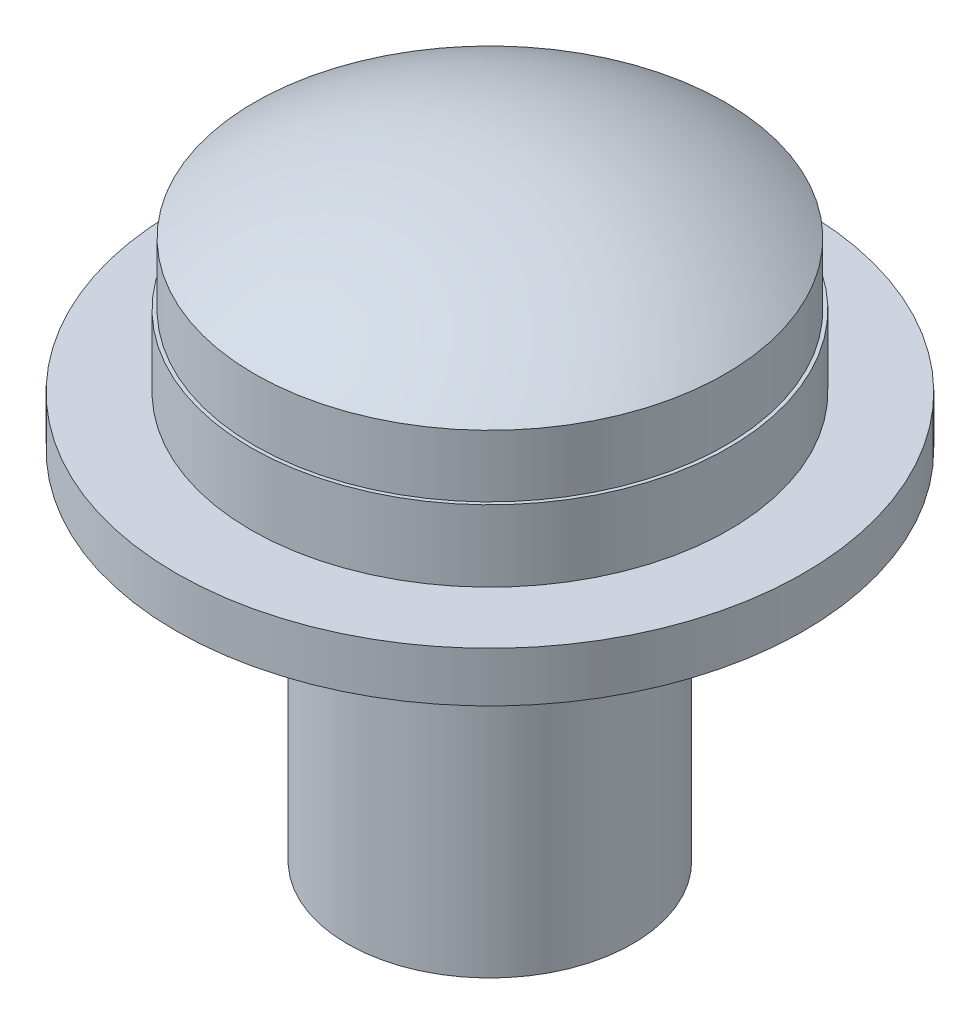
ISO-10303-21;
HEADER;
FILE_DESCRIPTION(('STEP AP214'),'2;1');
FILE_NAME('part.step','',(''),(''),'','','');
FILE_SCHEMA(('AUTOMOTIVE_DESIGN { 1 0 10303 214 1 1 1 1 }'));
ENDSEC;
DATA;
#1=APPLICATION_CONTEXT('core data for automotive mechanical design processes');
#2=APPLICATION_PROTOCOL_DEFINITION('international standard','automotive_design',2000,#1);
#3=PRODUCT_CONTEXT('',#1,'mechanical');
#4=PRODUCT('Part','Part','',(#3));
#5=PRODUCT_RELATED_PRODUCT_CATEGORY('part','',(#4));
#6=PRODUCT_DEFINITION_FORMATION('','',#4);
#7=PRODUCT_DEFINITION_CONTEXT('part definition',#1,'design');
#8=PRODUCT_DEFINITION('design','',#6,#7);
#9=PRODUCT_DEFINITION_SHAPE('','',#8);
#10=(LENGTH_UNIT() NAMED_UNIT(*) SI_UNIT(.MILLI.,.METRE.));
#11=(NAMED_UNIT(*) PLANE_ANGLE_UNIT() SI_UNIT($,.RADIAN.));
#12=(NAMED_UNIT(*) SI_UNIT($,.STERADIAN.) SOLID_ANGLE_UNIT());
#13=UNCERTAINTY_MEASURE_WITH_UNIT(LENGTH_MEASURE(1.E-05),#10,'distance_accuracy_value','');
#14=(GEOMETRIC_REPRESENTATION_CONTEXT(3) GLOBAL_UNCERTAINTY_ASSIGNED_CONTEXT((#13)) GLOBAL_UNIT_ASSIGNED_CONTEXT((#10,
#11,#12)) REPRESENTATION_CONTEXT('',''));
#15=CARTESIAN_POINT('',(0.,0.,0.));
#16=DIRECTION('',(0.,0.,1.));
#17=DIRECTION('',(1.,0.,0.));
#18=AXIS2_PLACEMENT_3D('',#15,#16,#17);
#19=CARTESIAN_POINT('',(0.,0.7,0.));
#20=DIRECTION('',(0.,-1.,0.));
#21=DIRECTION('',(0.,0.,-1.));
#22=AXIS2_PLACEMENT_3D('',#19,#20,#21);
#23=CYLINDRICAL_SURFACE('',#22,4.4);
#24=CARTESIAN_POINT('',(0.,0.7,0.));
#25=DIRECTION('',(0.,1.,0.));
#26=DIRECTION('',(0.,0.,1.));
#27=AXIS2_PLACEMENT_3D('',#24,#25,#26);
#28=CIRCLE('',#27,4.4);
#29=CARTESIAN_POINT('',(0.,0.7,4.4));
#30=VERTEX_POINT('',#29);
#31=EDGE_CURVE('E67',#30,#30,#28,.T.);
#32=ORIENTED_EDGE('',*,*,#31,.F.);
#33=EDGE_LOOP('',(#32));
#34=FACE_BOUND('',#33,.T.);
#35=CARTESIAN_POINT('',(0.,0.,0.));
#36=DIRECTION('',(0.,1.,0.));
#37=DIRECTION('',(0.,0.,1.));
#38=AXIS2_PLACEMENT_3D('',#35,#36,#37);
#39=CIRCLE('',#38,4.4);
#40=CARTESIAN_POINT('',(0.,0.,4.4));
#41=VERTEX_POINT('',#40);
#42=EDGE_CURVE('E64',#41,#41,#39,.T.);
#43=ORIENTED_EDGE('',*,*,#42,.T.);
#44=EDGE_LOOP('',(#43));
#45=FACE_BOUND('',#44,.T.);
#46=ADVANCED_FACE('F33',(#34,#45),#23,.T.);
#47=CARTESIAN_POINT('',(0.,0.7,0.));
#48=DIRECTION('',(0.,1.,0.));
#49=DIRECTION('',(0.,0.,1.));
#50=AXIS2_PLACEMENT_3D('',#47,#48,#49);
#51=PLANE('',#50);
#52=CARTESIAN_POINT('',(0.,0.7,0.));
#53=DIRECTION('',(0.,1.,0.));
#54=DIRECTION('',(0.,0.,1.));
#55=AXIS2_PLACEMENT_3D('',#52,#53,#54);
#56=CIRCLE('',#55,3.35);
#57=CARTESIAN_POINT('',(0.,0.7,3.35));
#58=VERTEX_POINT('',#57);
#59=EDGE_CURVE('E40',#58,#58,#56,.T.);
#60=ORIENTED_EDGE('',*,*,#59,.F.);
#61=EDGE_LOOP('',(#60));
#62=FACE_BOUND('',#61,.T.);
#63=ORIENTED_EDGE('',*,*,#31,.T.);
#64=EDGE_LOOP('',(#63));
#65=FACE_BOUND('',#64,.T.);
#66=ADVANCED_FACE('F76',(#62,#65),#51,.T.);
#67=CARTESIAN_POINT('',(0.,0.,0.));
#68=DIRECTION('',(0.,1.,0.));
#69=DIRECTION('',(0.,0.,1.));
#70=AXIS2_PLACEMENT_3D('',#67,#68,#69);
#71=PLANE('',#70);
#72=CARTESIAN_POINT('',(0.,0.,0.));
#73=DIRECTION('',(0.,-1.,0.));
#74=DIRECTION('',(0.,0.,-1.));
#75=AXIS2_PLACEMENT_3D('',#72,#73,#74);
#76=CIRCLE('',#75,2.);
#77=CARTESIAN_POINT('',(0.,0.,-2.));
#78=VERTEX_POINT('',#77);
#79=EDGE_CURVE('E11',#78,#78,#76,.T.);
#80=ORIENTED_EDGE('',*,*,#79,.F.);
#81=EDGE_LOOP('',(#80));
#82=FACE_BOUND('',#81,.T.);
#83=ORIENTED_EDGE('',*,*,#42,.F.);
#84=EDGE_LOOP('',(#83));
#85=FACE_BOUND('',#84,.T.);
#86=ADVANCED_FACE('F73',(#82,#85),#71,.F.);
#87=CARTESIAN_POINT('',(0.,1.7,0.));
#88=DIRECTION('',(0.,-1.,0.));
#89=DIRECTION('',(0.,0.,-1.));
#90=AXIS2_PLACEMENT_3D('',#87,#88,#89);
#91=CYLINDRICAL_SURFACE('',#90,3.35);
#92=CARTESIAN_POINT('',(0.,1.7,0.));
#93=DIRECTION('',(0.,-1.,0.));
#94=DIRECTION('',(0.,0.,-1.));
#95=AXIS2_PLACEMENT_3D('',#92,#93,#94);
#96=CIRCLE('',#95,3.35);
#97=CARTESIAN_POINT('',(0.,1.7,-3.35));
#98=VERTEX_POINT('',#97);
#99=EDGE_CURVE('E59',#98,#98,#96,.T.);
#100=ORIENTED_EDGE('',*,*,#99,.T.);
#101=EDGE_LOOP('',(#100));
#102=FACE_BOUND('',#101,.T.);
#103=ORIENTED_EDGE('',*,*,#59,.T.);
#104=EDGE_LOOP('',(#103));
#105=FACE_BOUND('',#104,.T.);
#106=ADVANCED_FACE('F75',(#102,#105),#91,.T.);
#107=CARTESIAN_POINT('',(0.,1.7,0.));
#108=DIRECTION('',(0.,-1.,0.));
#109=DIRECTION('',(0.,0.,-1.));
#110=AXIS2_PLACEMENT_3D('',#107,#108,#109);
#111=PLANE('',#110);
#112=CARTESIAN_POINT('',(0.,1.7,0.));
#113=DIRECTION('',(0.,-1.,0.));
#114=DIRECTION('',(0.,0.,-1.));
#115=AXIS2_PLACEMENT_3D('',#112,#113,#114);
#116=CIRCLE('',#115,3.3);
#117=CARTESIAN_POINT('',(0.,1.7,-3.3));
#118=VERTEX_POINT('',#117);
#119=EDGE_CURVE('E54',#118,#118,#116,.T.);
#120=ORIENTED_EDGE('',*,*,#119,.T.);
#121=EDGE_LOOP('',(#120));
#122=FACE_BOUND('',#121,.T.);
#123=ORIENTED_EDGE('',*,*,#99,.F.);
#124=EDGE_LOOP('',(#123));
#125=FACE_BOUND('',#124,.T.);
#126=ADVANCED_FACE('F82',(#122,#125),#111,.F.);
#127=CARTESIAN_POINT('',(0.,2.7,0.));
#128=DIRECTION('',(0.,-1.,0.));
#129=DIRECTION('',(0.,0.,-1.));
#130=AXIS2_PLACEMENT_3D('',#127,#128,#129);
#131=CYLINDRICAL_SURFACE('',#130,3.3);
#132=CARTESIAN_POINT('',(0.,2.56877569936667,0.));
#133=DIRECTION('',(0.,-1.,0.));
#134=DIRECTION('',(0.,0.,-1.));
#135=AXIS2_PLACEMENT_3D('',#132,#133,#134);
#136=CIRCLE('',#135,3.3);
#137=CARTESIAN_POINT('',(0.,2.56877569936667,-3.3));
#138=VERTEX_POINT('',#137);
#139=EDGE_CURVE('E36',#138,#138,#136,.F.);
#140=ORIENTED_EDGE('',*,*,#139,.F.);
#141=EDGE_LOOP('',(#140));
#142=FACE_BOUND('',#141,.T.);
#143=ORIENTED_EDGE('',*,*,#119,.F.);
#144=EDGE_LOOP('',(#143));
#145=FACE_BOUND('',#144,.T.);
#146=ADVANCED_FACE('F113',(#142,#145),#131,.T.);
#147=CARTESIAN_POINT('',(0.,-5.,0.));
#148=DIRECTION('',(0.,1.,0.));
#149=DIRECTION('',(0.,0.,1.));
#150=AXIS2_PLACEMENT_3D('',#147,#148,#149);
#151=CYLINDRICAL_SURFACE('',#150,2.);
#152=CARTESIAN_POINT('',(0.,-5.,0.));
#153=DIRECTION('',(0.,-1.,0.));
#154=DIRECTION('',(0.,0.,-1.));
#155=AXIS2_PLACEMENT_3D('',#152,#153,#154);
#156=CIRCLE('',#155,2.);
#157=CARTESIAN_POINT('',(0.,-5.,-2.));
#158=VERTEX_POINT('',#157);
#159=EDGE_CURVE('E52',#158,#158,#156,.T.);
#160=ORIENTED_EDGE('',*,*,#159,.F.);
#161=EDGE_LOOP('',(#160));
#162=FACE_BOUND('',#161,.T.);
#163=ORIENTED_EDGE('',*,*,#79,.T.);
#164=EDGE_LOOP('',(#163));
#165=FACE_BOUND('',#164,.T.);
#166=ADVANCED_FACE('F125',(#162,#165),#151,.T.);
#167=CARTESIAN_POINT('',(0.,-5.,0.));
#168=DIRECTION('',(0.,-1.,0.));
#169=DIRECTION('',(0.,0.,-1.));
#170=AXIS2_PLACEMENT_3D('',#167,#168,#169);
#171=PLANE('',#170);
#172=ORIENTED_EDGE('',*,*,#159,.T.);
#173=EDGE_LOOP('',(#172));
#174=FACE_BOUND('',#173,.T.);
#175=ADVANCED_FACE('F47',(#174),#171,.T.);
#176=CARTESIAN_POINT('',(0.,-2.19574373435316,0.));
#177=DIRECTION('',(0.,1.,0.));
#178=DIRECTION('',(0.,0.,-1.));
#179=AXIS2_PLACEMENT_3D('',#176,#177,#178);
#180=SPHERICAL_SURFACE('',#179,5.79574373435316);
#181=CARTESIAN_POINT('',(0.,3.6,0.));
#182=VERTEX_POINT('',#181);
#183=VERTEX_LOOP('',#182);
#184=FACE_BOUND('',#183,.T.);
#185=ORIENTED_EDGE('',*,*,#139,.T.);
#186=EDGE_LOOP('',(#185));
#187=FACE_BOUND('',#186,.T.);
#188=ADVANCED_FACE('F44',(#184,#187),#180,.T.);
#189=CLOSED_SHELL('',(#46,#66,#86,#106,#126,#146,#166,#175,#188));
#190=MANIFOLD_SOLID_BREP('B2',#189);
#191=ADVANCED_BREP_SHAPE_REPRESENTATION('',(#18,#190),#14);
#192=SHAPE_DEFINITION_REPRESENTATION(#9,#191);
ENDSEC;
END-ISO-10303-21;
